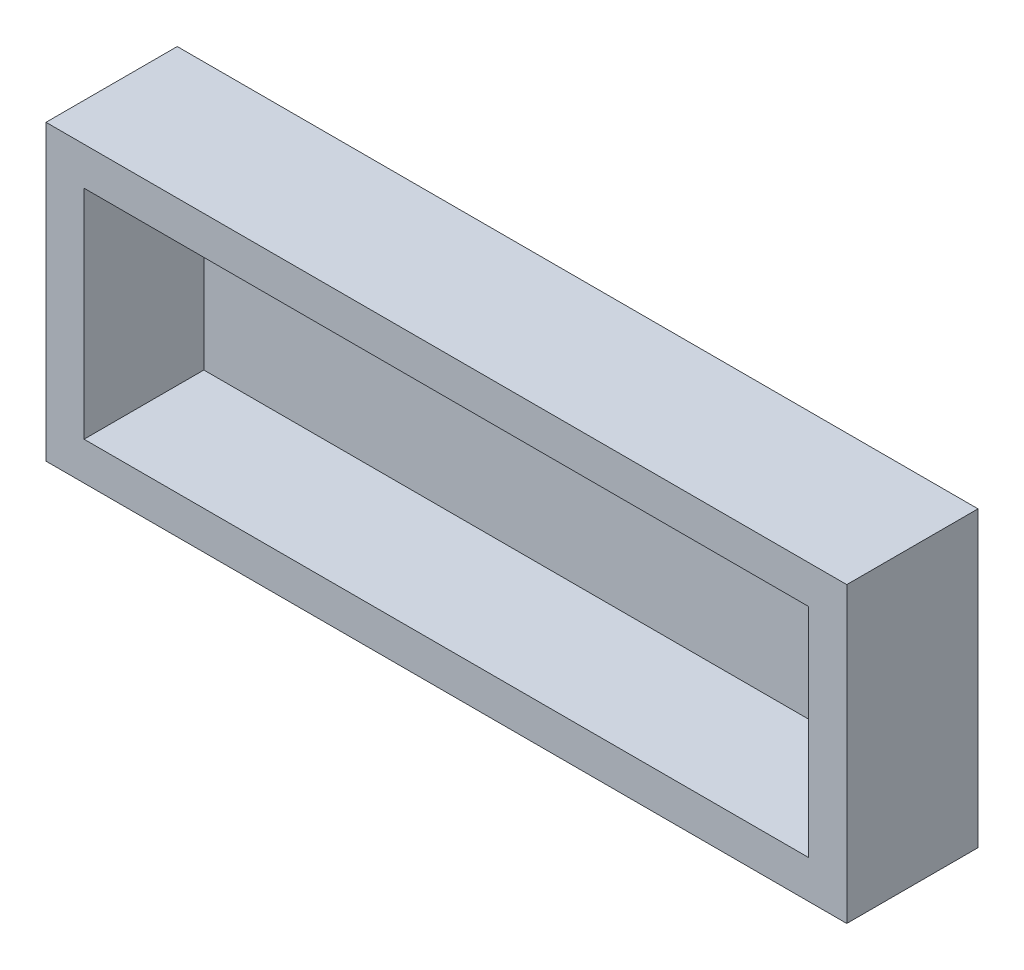
ISO-10303-21;
HEADER;
FILE_DESCRIPTION(('STEP AP214'),'2;1');
FILE_NAME('part.step','',(''),(''),'','','');
FILE_SCHEMA(('AUTOMOTIVE_DESIGN { 1 0 10303 214 1 1 1 1 }'));
ENDSEC;
DATA;
#1=APPLICATION_CONTEXT('core data for automotive mechanical design processes');
#2=APPLICATION_PROTOCOL_DEFINITION('international standard','automotive_design',2000,#1);
#3=PRODUCT_CONTEXT('',#1,'mechanical');
#4=PRODUCT('Part','Part','',(#3));
#5=PRODUCT_RELATED_PRODUCT_CATEGORY('part','',(#4));
#6=PRODUCT_DEFINITION_FORMATION('','',#4);
#7=PRODUCT_DEFINITION_CONTEXT('part definition',#1,'design');
#8=PRODUCT_DEFINITION('design','',#6,#7);
#9=PRODUCT_DEFINITION_SHAPE('','',#8);
#10=(LENGTH_UNIT() NAMED_UNIT(*) SI_UNIT(.MILLI.,.METRE.));
#11=(NAMED_UNIT(*) PLANE_ANGLE_UNIT() SI_UNIT($,.RADIAN.));
#12=(NAMED_UNIT(*) SI_UNIT($,.STERADIAN.) SOLID_ANGLE_UNIT());
#13=UNCERTAINTY_MEASURE_WITH_UNIT(LENGTH_MEASURE(1.E-05),#10,'distance_accuracy_value','');
#14=(GEOMETRIC_REPRESENTATION_CONTEXT(3) GLOBAL_UNCERTAINTY_ASSIGNED_CONTEXT((#13)) GLOBAL_UNIT_ASSIGNED_CONTEXT((#10,
#11,#12)) REPRESENTATION_CONTEXT('',''));
#15=CARTESIAN_POINT('',(0.,0.,0.));
#16=DIRECTION('',(0.,0.,1.));
#17=DIRECTION('',(1.,0.,0.));
#18=AXIS2_PLACEMENT_3D('',#15,#16,#17);
#19=CARTESIAN_POINT('',(-9.90490769999997,-9.74318500000001,34.5));
#20=DIRECTION('',(1.,0.,0.));
#21=DIRECTION('',(0.,0.,-1.));
#22=AXIS2_PLACEMENT_3D('',#19,#20,#21);
#23=PLANE('',#22);
#24=DIRECTION('',(0.,-1.,0.));
#25=VECTOR('',#24,1.);
#26=CARTESIAN_POINT('',(-9.90490769999997,-9.74318500000001,0.));
#27=LINE('',#26,#25);
#28=CARTESIAN_POINT('',(-9.90490769999997,67.407315,0.));
#29=VERTEX_POINT('',#28);
#30=CARTESIAN_POINT('',(-9.90490769999997,-9.74318500000001,0.));
#31=VERTEX_POINT('',#30);
#32=EDGE_CURVE('E169',#29,#31,#27,.T.);
#33=ORIENTED_EDGE('',*,*,#32,.T.);
#34=DIRECTION('',(0.,0.,-1.));
#35=VECTOR('',#34,1.);
#36=CARTESIAN_POINT('',(-9.90490769999997,-9.74318500000001,34.5));
#37=LINE('',#36,#35);
#38=CARTESIAN_POINT('',(-9.90490769999997,-9.74318500000001,34.5));
#39=VERTEX_POINT('',#38);
#40=EDGE_CURVE('E11',#39,#31,#37,.T.);
#41=ORIENTED_EDGE('',*,*,#40,.F.);
#42=DIRECTION('',(0.,-1.,0.));
#43=VECTOR('',#42,1.);
#44=CARTESIAN_POINT('',(-9.90490769999997,-9.74318500000001,34.5));
#45=LINE('',#44,#43);
#46=CARTESIAN_POINT('',(-9.90490769999997,67.407315,34.5));
#47=VERTEX_POINT('',#46);
#48=EDGE_CURVE('E158',#47,#39,#45,.T.);
#49=ORIENTED_EDGE('',*,*,#48,.F.);
#50=DIRECTION('',(0.,0.,-1.));
#51=VECTOR('',#50,1.);
#52=CARTESIAN_POINT('',(-9.90490769999997,67.407315,34.5));
#53=LINE('',#52,#51);
#54=EDGE_CURVE('E168',#47,#29,#53,.T.);
#55=ORIENTED_EDGE('',*,*,#54,.T.);
#56=EDGE_LOOP('',(#33,#41,#49,#55));
#57=FACE_BOUND('',#56,.T.);
#58=ADVANCED_FACE('F41',(#57),#23,.F.);
#59=CARTESIAN_POINT('',(200.5959923,-9.74318499999999,34.5));
#60=DIRECTION('',(0.,1.,0.));
#61=DIRECTION('',(-1.,0.,0.));
#62=AXIS2_PLACEMENT_3D('',#59,#60,#61);
#63=PLANE('',#62);
#64=DIRECTION('',(1.,0.,0.));
#65=VECTOR('',#64,1.);
#66=CARTESIAN_POINT('',(200.5959923,-9.74318499999999,0.));
#67=LINE('',#66,#65);
#68=CARTESIAN_POINT('',(200.5959923,-9.74318499999999,0.));
#69=VERTEX_POINT('',#68);
#70=EDGE_CURVE('E173',#31,#69,#67,.T.);
#71=ORIENTED_EDGE('',*,*,#70,.T.);
#72=DIRECTION('',(0.,0.,-1.));
#73=VECTOR('',#72,1.);
#74=CARTESIAN_POINT('',(200.5959923,-9.74318499999999,34.5));
#75=LINE('',#74,#73);
#76=CARTESIAN_POINT('',(200.5959923,-9.74318499999999,34.5));
#77=VERTEX_POINT('',#76);
#78=EDGE_CURVE('E49',#77,#69,#75,.T.);
#79=ORIENTED_EDGE('',*,*,#78,.F.);
#80=DIRECTION('',(1.,0.,0.));
#81=VECTOR('',#80,1.);
#82=CARTESIAN_POINT('',(200.5959923,-9.74318499999999,34.5));
#83=LINE('',#82,#81);
#84=EDGE_CURVE('E93',#39,#77,#83,.T.);
#85=ORIENTED_EDGE('',*,*,#84,.F.);
#86=ORIENTED_EDGE('',*,*,#40,.T.);
#87=EDGE_LOOP('',(#71,#79,#85,#86));
#88=FACE_BOUND('',#87,.T.);
#89=ADVANCED_FACE('F208',(#88),#63,.F.);
#90=CARTESIAN_POINT('',(200.5959923,-9.74318499999999,34.5));
#91=DIRECTION('',(-1.,0.,0.));
#92=DIRECTION('',(0.,0.,1.));
#93=AXIS2_PLACEMENT_3D('',#90,#91,#92);
#94=PLANE('',#93);
#95=DIRECTION('',(0.,1.,0.));
#96=VECTOR('',#95,1.);
#97=CARTESIAN_POINT('',(200.5959923,-9.74318499999999,0.));
#98=LINE('',#97,#96);
#99=CARTESIAN_POINT('',(200.5959923,67.407315,0.));
#100=VERTEX_POINT('',#99);
#101=EDGE_CURVE('E176',#69,#100,#98,.T.);
#102=ORIENTED_EDGE('',*,*,#101,.T.);
#103=DIRECTION('',(0.,0.,-1.));
#104=VECTOR('',#103,1.);
#105=CARTESIAN_POINT('',(200.5959923,67.407315,34.5));
#106=LINE('',#105,#104);
#107=CARTESIAN_POINT('',(200.5959923,67.407315,34.5));
#108=VERTEX_POINT('',#107);
#109=EDGE_CURVE('E183',#108,#100,#106,.T.);
#110=ORIENTED_EDGE('',*,*,#109,.F.);
#111=DIRECTION('',(0.,1.,0.));
#112=VECTOR('',#111,1.);
#113=CARTESIAN_POINT('',(200.5959923,-9.74318499999999,34.5));
#114=LINE('',#113,#112);
#115=EDGE_CURVE('E163',#77,#108,#114,.T.);
#116=ORIENTED_EDGE('',*,*,#115,.F.);
#117=ORIENTED_EDGE('',*,*,#78,.T.);
#118=EDGE_LOOP('',(#102,#110,#116,#117));
#119=FACE_BOUND('',#118,.T.);
#120=ADVANCED_FACE('F190',(#119),#94,.F.);
#121=CARTESIAN_POINT('',(200.5959923,67.407315,34.5));
#122=DIRECTION('',(0.,-1.,0.));
#123=DIRECTION('',(1.,0.,0.));
#124=AXIS2_PLACEMENT_3D('',#121,#122,#123);
#125=PLANE('',#124);
#126=DIRECTION('',(-1.,0.,0.));
#127=VECTOR('',#126,1.);
#128=CARTESIAN_POINT('',(200.5959923,67.407315,0.));
#129=LINE('',#128,#127);
#130=EDGE_CURVE('E86',#100,#29,#129,.T.);
#131=ORIENTED_EDGE('',*,*,#130,.T.);
#132=ORIENTED_EDGE('',*,*,#54,.F.);
#133=DIRECTION('',(-1.,0.,0.));
#134=VECTOR('',#133,1.);
#135=CARTESIAN_POINT('',(200.5959923,67.407315,34.5));
#136=LINE('',#135,#134);
#137=EDGE_CURVE('E65',#108,#47,#136,.T.);
#138=ORIENTED_EDGE('',*,*,#137,.F.);
#139=ORIENTED_EDGE('',*,*,#109,.T.);
#140=EDGE_LOOP('',(#131,#132,#138,#139));
#141=FACE_BOUND('',#140,.T.);
#142=ADVANCED_FACE('F198',(#141),#125,.F.);
#143=CARTESIAN_POINT('',(0.,0.,34.5));
#144=DIRECTION('',(0.,0.,1.));
#145=DIRECTION('',(1.,0.,0.));
#146=AXIS2_PLACEMENT_3D('',#143,#144,#145);
#147=PLANE('',#146);
#148=DIRECTION('',(0.,-1.,0.));
#149=VECTOR('',#148,1.);
#150=CARTESIAN_POINT('',(0.095092300000035,-9.74318500000001,34.5));
#151=LINE('',#150,#149);
#152=CARTESIAN_POINT('',(0.095092300000035,57.407315,34.5));
#153=VERTEX_POINT('',#152);
#154=CARTESIAN_POINT('',(0.095092300000035,0.25681499999999,34.5));
#155=VERTEX_POINT('',#154);
#156=EDGE_CURVE('E142',#153,#155,#151,.T.);
#157=ORIENTED_EDGE('',*,*,#156,.F.);
#158=DIRECTION('',(-1.,0.,0.));
#159=VECTOR('',#158,1.);
#160=CARTESIAN_POINT('',(200.5959923,57.407315,34.5));
#161=LINE('',#160,#159);
#162=CARTESIAN_POINT('',(190.5959923,57.407315,34.5));
#163=VERTEX_POINT('',#162);
#164=EDGE_CURVE('E155',#163,#153,#161,.T.);
#165=ORIENTED_EDGE('',*,*,#164,.F.);
#166=DIRECTION('',(0.,1.,0.));
#167=VECTOR('',#166,1.);
#168=CARTESIAN_POINT('',(190.5959923,-9.74318499999999,34.5));
#169=LINE('',#168,#167);
#170=CARTESIAN_POINT('',(190.5959923,0.256815000000013,34.5));
#171=VERTEX_POINT('',#170);
#172=EDGE_CURVE('E152',#171,#163,#169,.T.);
#173=ORIENTED_EDGE('',*,*,#172,.F.);
#174=DIRECTION('',(1.,0.,0.));
#175=VECTOR('',#174,1.);
#176=CARTESIAN_POINT('',(200.5959923,0.256815000000014,34.5));
#177=LINE('',#176,#175);
#178=EDGE_CURVE('E131',#155,#171,#177,.T.);
#179=ORIENTED_EDGE('',*,*,#178,.F.);
#180=EDGE_LOOP('',(#157,#165,#173,#179));
#181=FACE_BOUND('',#180,.T.);
#182=ORIENTED_EDGE('',*,*,#48,.T.);
#183=ORIENTED_EDGE('',*,*,#84,.T.);
#184=ORIENTED_EDGE('',*,*,#115,.T.);
#185=ORIENTED_EDGE('',*,*,#137,.T.);
#186=EDGE_LOOP('',(#182,#183,#184,#185));
#187=FACE_BOUND('',#186,.T.);
#188=ADVANCED_FACE('F200',(#181,#187),#147,.T.);
#189=CARTESIAN_POINT('',(0.,0.,0.));
#190=DIRECTION('',(0.,0.,1.));
#191=DIRECTION('',(1.,0.,0.));
#192=AXIS2_PLACEMENT_3D('',#189,#190,#191);
#193=PLANE('',#192);
#194=CARTESIAN_POINT('',(38.19575,38.357,0.));
#195=DIRECTION('',(0.,0.,1.));
#196=DIRECTION('',(1.,0.,0.));
#197=AXIS2_PLACEMENT_3D('',#194,#195,#196);
#198=CIRCLE('',#197,2.);
#199=CARTESIAN_POINT('',(40.19575,38.357,0.));
#200=VERTEX_POINT('',#199);
#201=EDGE_CURVE('E303',#200,#200,#198,.T.);
#202=ORIENTED_EDGE('',*,*,#201,.T.);
#203=EDGE_LOOP('',(#202));
#204=FACE_BOUND('',#203,.T.);
#205=ORIENTED_EDGE('',*,*,#32,.F.);
#206=ORIENTED_EDGE('',*,*,#130,.F.);
#207=ORIENTED_EDGE('',*,*,#101,.F.);
#208=ORIENTED_EDGE('',*,*,#70,.F.);
#209=EDGE_LOOP('',(#205,#206,#207,#208));
#210=FACE_BOUND('',#209,.T.);
#211=ADVANCED_FACE('F194',(#204,#210),#193,.F.);
#212=CARTESIAN_POINT('',(0.095092300000035,-9.74318500000001,34.5));
#213=DIRECTION('',(1.,0.,0.));
#214=DIRECTION('',(0.,0.,-1.));
#215=AXIS2_PLACEMENT_3D('',#212,#213,#214);
#216=PLANE('',#215);
#217=DIRECTION('',(0.,-1.,0.));
#218=VECTOR('',#217,1.);
#219=CARTESIAN_POINT('',(0.095092300000035,-9.74318500000001,3.));
#220=LINE('',#219,#218);
#221=CARTESIAN_POINT('',(0.095092300000035,57.407315,3.));
#222=VERTEX_POINT('',#221);
#223=CARTESIAN_POINT('',(0.095092300000035,0.25681499999999,3.));
#224=VERTEX_POINT('',#223);
#225=EDGE_CURVE('E121',#222,#224,#220,.T.);
#226=ORIENTED_EDGE('',*,*,#225,.F.);
#227=DIRECTION('',(0.,0.,-1.));
#228=VECTOR('',#227,1.);
#229=CARTESIAN_POINT('',(0.095092300000035,57.407315,34.5));
#230=LINE('',#229,#228);
#231=EDGE_CURVE('E146',#153,#222,#230,.T.);
#232=ORIENTED_EDGE('',*,*,#231,.F.);
#233=ORIENTED_EDGE('',*,*,#156,.T.);
#234=DIRECTION('',(0.,0.,-1.));
#235=VECTOR('',#234,1.);
#236=CARTESIAN_POINT('',(0.0950923000000437,0.25681499999999,34.5));
#237=LINE('',#236,#235);
#238=EDGE_CURVE('E135',#155,#224,#237,.T.);
#239=ORIENTED_EDGE('',*,*,#238,.T.);
#240=EDGE_LOOP('',(#226,#232,#233,#239));
#241=FACE_BOUND('',#240,.T.);
#242=ADVANCED_FACE('F238',(#241),#216,.T.);
#243=CARTESIAN_POINT('',(200.5959923,0.256815000000014,34.5));
#244=DIRECTION('',(0.,1.,0.));
#245=DIRECTION('',(-1.,0.,0.));
#246=AXIS2_PLACEMENT_3D('',#243,#244,#245);
#247=PLANE('',#246);
#248=DIRECTION('',(1.,0.,0.));
#249=VECTOR('',#248,1.);
#250=CARTESIAN_POINT('',(200.5959923,0.256815000000014,3.));
#251=LINE('',#250,#249);
#252=CARTESIAN_POINT('',(190.5959923,0.256815000000013,3.));
#253=VERTEX_POINT('',#252);
#254=EDGE_CURVE('E115',#224,#253,#251,.T.);
#255=ORIENTED_EDGE('',*,*,#254,.F.);
#256=ORIENTED_EDGE('',*,*,#238,.F.);
#257=ORIENTED_EDGE('',*,*,#178,.T.);
#258=DIRECTION('',(0.,0.,-1.));
#259=VECTOR('',#258,1.);
#260=CARTESIAN_POINT('',(190.5959923,0.256815000000013,34.5));
#261=LINE('',#260,#259);
#262=EDGE_CURVE('E128',#171,#253,#261,.T.);
#263=ORIENTED_EDGE('',*,*,#262,.T.);
#264=EDGE_LOOP('',(#255,#256,#257,#263));
#265=FACE_BOUND('',#264,.T.);
#266=ADVANCED_FACE('F129',(#265),#247,.T.);
#267=CARTESIAN_POINT('',(190.5959923,-9.74318499999999,34.5));
#268=DIRECTION('',(-1.,0.,0.));
#269=DIRECTION('',(0.,0.,1.));
#270=AXIS2_PLACEMENT_3D('',#267,#268,#269);
#271=PLANE('',#270);
#272=DIRECTION('',(0.,1.,0.));
#273=VECTOR('',#272,1.);
#274=CARTESIAN_POINT('',(190.5959923,-9.74318499999999,3.));
#275=LINE('',#274,#273);
#276=CARTESIAN_POINT('',(190.5959923,57.407315,3.));
#277=VERTEX_POINT('',#276);
#278=EDGE_CURVE('E119',#253,#277,#275,.T.);
#279=ORIENTED_EDGE('',*,*,#278,.F.);
#280=ORIENTED_EDGE('',*,*,#262,.F.);
#281=ORIENTED_EDGE('',*,*,#172,.T.);
#282=DIRECTION('',(0.,0.,-1.));
#283=VECTOR('',#282,1.);
#284=CARTESIAN_POINT('',(190.5959923,57.407315,34.5));
#285=LINE('',#284,#283);
#286=EDGE_CURVE('E56',#163,#277,#285,.T.);
#287=ORIENTED_EDGE('',*,*,#286,.T.);
#288=EDGE_LOOP('',(#279,#280,#281,#287));
#289=FACE_BOUND('',#288,.T.);
#290=ADVANCED_FACE('F137',(#289),#271,.T.);
#291=CARTESIAN_POINT('',(200.5959923,57.407315,34.5));
#292=DIRECTION('',(0.,-1.,0.));
#293=DIRECTION('',(1.,0.,0.));
#294=AXIS2_PLACEMENT_3D('',#291,#292,#293);
#295=PLANE('',#294);
#296=DIRECTION('',(-1.,0.,0.));
#297=VECTOR('',#296,1.);
#298=CARTESIAN_POINT('',(200.5959923,57.407315,3.));
#299=LINE('',#298,#297);
#300=EDGE_CURVE('E139',#277,#222,#299,.T.);
#301=ORIENTED_EDGE('',*,*,#300,.F.);
#302=ORIENTED_EDGE('',*,*,#286,.F.);
#303=ORIENTED_EDGE('',*,*,#164,.T.);
#304=ORIENTED_EDGE('',*,*,#231,.T.);
#305=EDGE_LOOP('',(#301,#302,#303,#304));
#306=FACE_BOUND('',#305,.T.);
#307=ADVANCED_FACE('F260',(#306),#295,.T.);
#308=CARTESIAN_POINT('',(0.,0.,3.));
#309=DIRECTION('',(0.,0.,1.));
#310=DIRECTION('',(1.,0.,0.));
#311=AXIS2_PLACEMENT_3D('',#308,#309,#310);
#312=PLANE('',#311);
#313=CARTESIAN_POINT('',(38.19575,38.357,3.));
#314=DIRECTION('',(0.,0.,1.));
#315=DIRECTION('',(1.,0.,0.));
#316=AXIS2_PLACEMENT_3D('',#313,#314,#315);
#317=CIRCLE('',#316,2.);
#318=CARTESIAN_POINT('',(40.19575,38.357,3.));
#319=VERTEX_POINT('',#318);
#320=EDGE_CURVE('E300',#319,#319,#317,.T.);
#321=ORIENTED_EDGE('',*,*,#320,.F.);
#322=EDGE_LOOP('',(#321));
#323=FACE_BOUND('',#322,.T.);
#324=ORIENTED_EDGE('',*,*,#225,.T.);
#325=ORIENTED_EDGE('',*,*,#254,.T.);
#326=ORIENTED_EDGE('',*,*,#278,.T.);
#327=ORIENTED_EDGE('',*,*,#300,.T.);
#328=EDGE_LOOP('',(#324,#325,#326,#327));
#329=FACE_BOUND('',#328,.T.);
#330=ADVANCED_FACE('F117',(#323,#329),#312,.T.);
#331=CARTESIAN_POINT('',(38.19575,38.357,3.));
#332=DIRECTION('',(0.,0.,-1.));
#333=DIRECTION('',(-1.,0.,0.));
#334=AXIS2_PLACEMENT_3D('',#331,#332,#333);
#335=CYLINDRICAL_SURFACE('',#334,2.);
#336=ORIENTED_EDGE('',*,*,#320,.T.);
#337=EDGE_LOOP('',(#336));
#338=FACE_BOUND('',#337,.T.);
#339=ORIENTED_EDGE('',*,*,#201,.F.);
#340=EDGE_LOOP('',(#339));
#341=FACE_BOUND('',#340,.T.);
#342=ADVANCED_FACE('F283',(#338,#341),#335,.F.);
#343=CLOSED_SHELL('',(#58,#89,#120,#142,#188,#211,#242,#266,#290,#307,#330,#342));
#344=MANIFOLD_SOLID_BREP('B2',#343);
#345=ADVANCED_BREP_SHAPE_REPRESENTATION('',(#18,#344),#14);
#346=SHAPE_DEFINITION_REPRESENTATION(#9,#345);
ENDSEC;
END-ISO-10303-21;
